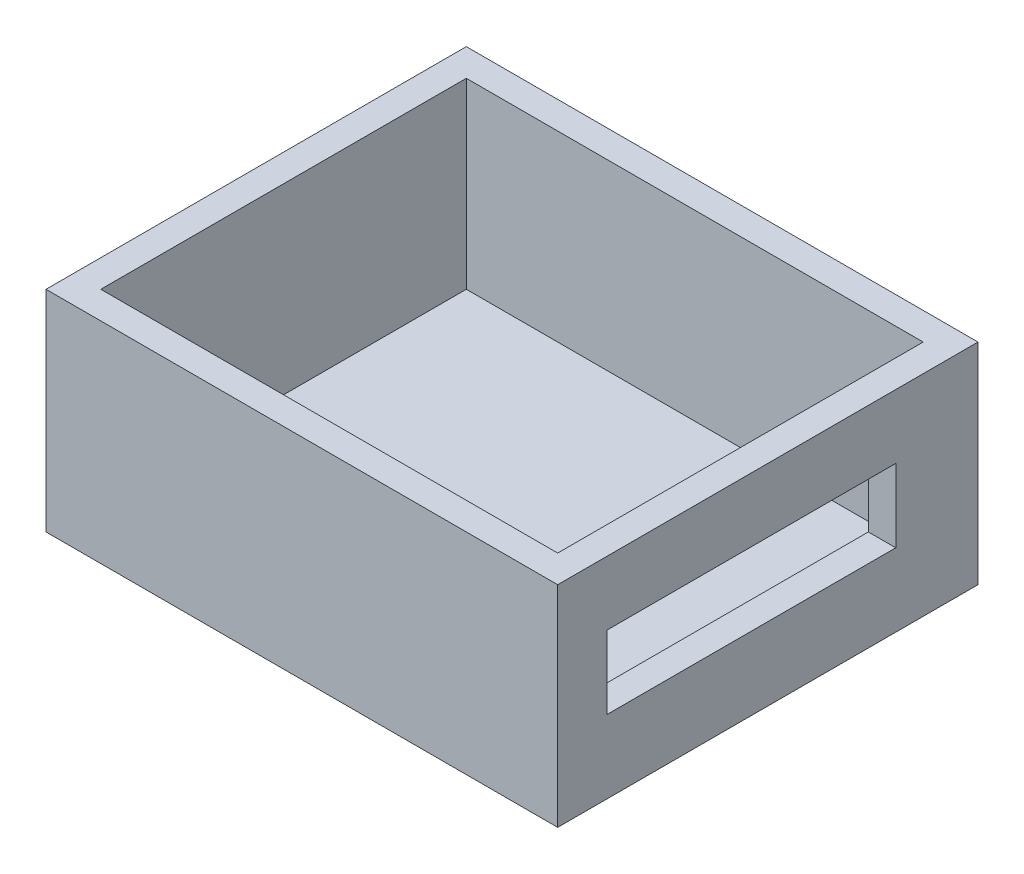
ISO-10303-21;
HEADER;
FILE_DESCRIPTION(('STEP AP214'),'2;1');
FILE_NAME('part.step','',(''),(''),'','','');
FILE_SCHEMA(('AUTOMOTIVE_DESIGN { 1 0 10303 214 1 1 1 1 }'));
ENDSEC;
DATA;
#1=APPLICATION_CONTEXT('core data for automotive mechanical design processes');
#2=APPLICATION_PROTOCOL_DEFINITION('international standard','automotive_design',2000,#1);
#3=PRODUCT_CONTEXT('',#1,'mechanical');
#4=PRODUCT('Part','Part','',(#3));
#5=PRODUCT_RELATED_PRODUCT_CATEGORY('part','',(#4));
#6=PRODUCT_DEFINITION_FORMATION('','',#4);
#7=PRODUCT_DEFINITION_CONTEXT('part definition',#1,'design');
#8=PRODUCT_DEFINITION('design','',#6,#7);
#9=PRODUCT_DEFINITION_SHAPE('','',#8);
#10=(LENGTH_UNIT() NAMED_UNIT(*) SI_UNIT(.MILLI.,.METRE.));
#11=(NAMED_UNIT(*) PLANE_ANGLE_UNIT() SI_UNIT($,.RADIAN.));
#12=(NAMED_UNIT(*) SI_UNIT($,.STERADIAN.) SOLID_ANGLE_UNIT());
#13=UNCERTAINTY_MEASURE_WITH_UNIT(LENGTH_MEASURE(1.E-05),#10,'distance_accuracy_value','');
#14=(GEOMETRIC_REPRESENTATION_CONTEXT(3) GLOBAL_UNCERTAINTY_ASSIGNED_CONTEXT((#13)) GLOBAL_UNIT_ASSIGNED_CONTEXT((#10,
#11,#12)) REPRESENTATION_CONTEXT('',''));
#15=CARTESIAN_POINT('',(0.,0.,0.));
#16=DIRECTION('',(0.,0.,1.));
#17=DIRECTION('',(1.,0.,0.));
#18=AXIS2_PLACEMENT_3D('',#15,#16,#17);
#19=CARTESIAN_POINT('',(0.,1.5,0.));
#20=DIRECTION('',(0.,-1.,0.));
#21=DIRECTION('',(0.,0.,-1.));
#22=AXIS2_PLACEMENT_3D('',#19,#20,#21);
#23=PLANE('',#22);
#24=DIRECTION('',(0.,0.,1.));
#25=VECTOR('',#24,1.);
#26=CARTESIAN_POINT('',(0.,1.5,0.));
#27=LINE('',#26,#25);
#28=CARTESIAN_POINT('',(0.,1.5,-20.));
#29=VERTEX_POINT('',#28);
#30=CARTESIAN_POINT('',(0.,1.5,0.));
#31=VERTEX_POINT('',#30);
#32=EDGE_CURVE('E203',#29,#31,#27,.T.);
#33=ORIENTED_EDGE('',*,*,#32,.T.);
#34=DIRECTION('',(1.,0.,0.));
#35=VECTOR('',#34,1.);
#36=CARTESIAN_POINT('',(0.,1.5,0.));
#37=LINE('',#36,#35);
#38=CARTESIAN_POINT('',(25.,1.5,0.));
#39=VERTEX_POINT('',#38);
#40=EDGE_CURVE('E211',#31,#39,#37,.T.);
#41=ORIENTED_EDGE('',*,*,#40,.T.);
#42=DIRECTION('',(0.,0.,-1.));
#43=VECTOR('',#42,1.);
#44=CARTESIAN_POINT('',(25.,1.5,0.));
#45=LINE('',#44,#43);
#46=CARTESIAN_POINT('',(25.,1.5,-20.));
#47=VERTEX_POINT('',#46);
#48=EDGE_CURVE('E214',#39,#47,#45,.T.);
#49=ORIENTED_EDGE('',*,*,#48,.T.);
#50=DIRECTION('',(-1.,0.,0.));
#51=VECTOR('',#50,1.);
#52=CARTESIAN_POINT('',(0.,1.5,-20.));
#53=LINE('',#52,#51);
#54=EDGE_CURVE('E217',#47,#29,#53,.T.);
#55=ORIENTED_EDGE('',*,*,#54,.T.);
#56=EDGE_LOOP('',(#33,#41,#49,#55));
#57=FACE_BOUND('',#56,.T.);
#58=ADVANCED_FACE('F37',(#57),#23,.F.);
#59=CARTESIAN_POINT('',(25.,11.5,0.));
#60=DIRECTION('',(0.,0.,1.));
#61=DIRECTION('',(1.,0.,0.));
#62=AXIS2_PLACEMENT_3D('',#59,#60,#61);
#63=PLANE('',#62);
#64=DIRECTION('',(0.,-1.,0.));
#65=VECTOR('',#64,1.);
#66=CARTESIAN_POINT('',(25.,11.5,0.));
#67=LINE('',#66,#65);
#68=CARTESIAN_POINT('',(25.,11.5,0.));
#69=VERTEX_POINT('',#68);
#70=EDGE_CURVE('E166',#69,#39,#67,.T.);
#71=ORIENTED_EDGE('',*,*,#70,.T.);
#72=ORIENTED_EDGE('',*,*,#40,.F.);
#73=DIRECTION('',(0.,-1.,0.));
#74=VECTOR('',#73,1.);
#75=CARTESIAN_POINT('',(0.,11.5,0.));
#76=LINE('',#75,#74);
#77=CARTESIAN_POINT('',(0.,11.5,0.));
#78=VERTEX_POINT('',#77);
#79=EDGE_CURVE('E165',#78,#31,#76,.T.);
#80=ORIENTED_EDGE('',*,*,#79,.F.);
#81=DIRECTION('',(-1.,0.,0.));
#82=VECTOR('',#81,1.);
#83=CARTESIAN_POINT('',(25.,11.5,0.));
#84=LINE('',#83,#82);
#85=EDGE_CURVE('E151',#69,#78,#84,.T.);
#86=ORIENTED_EDGE('',*,*,#85,.F.);
#87=EDGE_LOOP('',(#71,#72,#80,#86));
#88=FACE_BOUND('',#87,.T.);
#89=ADVANCED_FACE('F243',(#88),#63,.F.);
#90=CARTESIAN_POINT('',(25.,11.5,-20.));
#91=DIRECTION('',(1.,0.,0.));
#92=DIRECTION('',(0.,0.,-1.));
#93=AXIS2_PLACEMENT_3D('',#90,#91,#92);
#94=PLANE('',#93);
#95=DIRECTION('',(0.,0.,-1.));
#96=VECTOR('',#95,1.);
#97=CARTESIAN_POINT('',(25.,8.,-17.));
#98=LINE('',#97,#96);
#99=CARTESIAN_POINT('',(25.,8.,-1.2));
#100=VERTEX_POINT('',#99);
#101=CARTESIAN_POINT('',(25.,8.,-17.));
#102=VERTEX_POINT('',#101);
#103=EDGE_CURVE('E137',#100,#102,#98,.T.);
#104=ORIENTED_EDGE('',*,*,#103,.F.);
#105=DIRECTION('',(0.,1.,0.));
#106=VECTOR('',#105,1.);
#107=CARTESIAN_POINT('',(25.,8.,-1.2));
#108=LINE('',#107,#106);
#109=CARTESIAN_POINT('',(25.,4.,-1.2));
#110=VERTEX_POINT('',#109);
#111=EDGE_CURVE('E52',#110,#100,#108,.T.);
#112=ORIENTED_EDGE('',*,*,#111,.F.);
#113=DIRECTION('',(0.,0.,1.));
#114=VECTOR('',#113,1.);
#115=CARTESIAN_POINT('',(25.,4.,-17.));
#116=LINE('',#115,#114);
#117=CARTESIAN_POINT('',(25.,4.,-17.));
#118=VERTEX_POINT('',#117);
#119=EDGE_CURVE('E144',#118,#110,#116,.T.);
#120=ORIENTED_EDGE('',*,*,#119,.F.);
#121=DIRECTION('',(0.,-1.,0.));
#122=VECTOR('',#121,1.);
#123=CARTESIAN_POINT('',(25.,8.,-17.));
#124=LINE('',#123,#122);
#125=EDGE_CURVE('E128',#102,#118,#124,.T.);
#126=ORIENTED_EDGE('',*,*,#125,.F.);
#127=EDGE_LOOP('',(#104,#112,#120,#126));
#128=FACE_BOUND('',#127,.T.);
#129=DIRECTION('',(0.,-1.,0.));
#130=VECTOR('',#129,1.);
#131=CARTESIAN_POINT('',(25.,11.5,-20.));
#132=LINE('',#131,#130);
#133=CARTESIAN_POINT('',(25.,11.5,-20.));
#134=VERTEX_POINT('',#133);
#135=EDGE_CURVE('E170',#134,#47,#132,.T.);
#136=ORIENTED_EDGE('',*,*,#135,.T.);
#137=ORIENTED_EDGE('',*,*,#48,.F.);
#138=ORIENTED_EDGE('',*,*,#70,.F.);
#139=DIRECTION('',(0.,0.,1.));
#140=VECTOR('',#139,1.);
#141=CARTESIAN_POINT('',(25.,11.5,-20.));
#142=LINE('',#141,#140);
#143=EDGE_CURVE('E162',#134,#69,#142,.T.);
#144=ORIENTED_EDGE('',*,*,#143,.F.);
#145=EDGE_LOOP('',(#136,#137,#138,#144));
#146=FACE_BOUND('',#145,.T.);
#147=ADVANCED_FACE('F141',(#128,#146),#94,.F.);
#148=CARTESIAN_POINT('',(0.,11.5,-20.));
#149=DIRECTION('',(0.,0.,-1.));
#150=DIRECTION('',(-1.,0.,0.));
#151=AXIS2_PLACEMENT_3D('',#148,#149,#150);
#152=PLANE('',#151);
#153=DIRECTION('',(0.,-1.,0.));
#154=VECTOR('',#153,1.);
#155=CARTESIAN_POINT('',(0.,11.5,-20.));
#156=LINE('',#155,#154);
#157=CARTESIAN_POINT('',(0.,11.5,-20.));
#158=VERTEX_POINT('',#157);
#159=EDGE_CURVE('E173',#158,#29,#156,.T.);
#160=ORIENTED_EDGE('',*,*,#159,.T.);
#161=ORIENTED_EDGE('',*,*,#54,.F.);
#162=ORIENTED_EDGE('',*,*,#135,.F.);
#163=DIRECTION('',(1.,0.,0.));
#164=VECTOR('',#163,1.);
#165=CARTESIAN_POINT('',(0.,11.5,-20.));
#166=LINE('',#165,#164);
#167=EDGE_CURVE('E159',#158,#134,#166,.T.);
#168=ORIENTED_EDGE('',*,*,#167,.F.);
#169=EDGE_LOOP('',(#160,#161,#162,#168));
#170=FACE_BOUND('',#169,.T.);
#171=ADVANCED_FACE('F271',(#170),#152,.F.);
#172=CARTESIAN_POINT('',(0.,11.5,0.));
#173=DIRECTION('',(-1.,0.,0.));
#174=DIRECTION('',(0.,0.,1.));
#175=AXIS2_PLACEMENT_3D('',#172,#173,#174);
#176=PLANE('',#175);
#177=ORIENTED_EDGE('',*,*,#79,.T.);
#178=ORIENTED_EDGE('',*,*,#32,.F.);
#179=ORIENTED_EDGE('',*,*,#159,.F.);
#180=DIRECTION('',(0.,0.,-1.));
#181=VECTOR('',#180,1.);
#182=CARTESIAN_POINT('',(0.,11.5,0.));
#183=LINE('',#182,#181);
#184=EDGE_CURVE('E156',#78,#158,#183,.T.);
#185=ORIENTED_EDGE('',*,*,#184,.F.);
#186=EDGE_LOOP('',(#177,#178,#179,#185));
#187=FACE_BOUND('',#186,.T.);
#188=ADVANCED_FACE('F254',(#187),#176,.F.);
#189=CARTESIAN_POINT('',(26.5,11.5,1.5));
#190=DIRECTION('',(0.,0.,1.));
#191=DIRECTION('',(1.,0.,0.));
#192=AXIS2_PLACEMENT_3D('',#189,#190,#191);
#193=PLANE('',#192);
#194=DIRECTION('',(-1.,0.,0.));
#195=VECTOR('',#194,1.);
#196=CARTESIAN_POINT('',(26.5,0.,1.5));
#197=LINE('',#196,#195);
#198=CARTESIAN_POINT('',(26.5,0.,1.5));
#199=VERTEX_POINT('',#198);
#200=CARTESIAN_POINT('',(-1.5,0.,1.5));
#201=VERTEX_POINT('',#200);
#202=EDGE_CURVE('E169',#199,#201,#197,.T.);
#203=ORIENTED_EDGE('',*,*,#202,.F.);
#204=DIRECTION('',(0.,-1.,0.));
#205=VECTOR('',#204,1.);
#206=CARTESIAN_POINT('',(26.5,11.5,1.5));
#207=LINE('',#206,#205);
#208=CARTESIAN_POINT('',(26.5,11.5,1.5));
#209=VERTEX_POINT('',#208);
#210=EDGE_CURVE('E201',#209,#199,#207,.T.);
#211=ORIENTED_EDGE('',*,*,#210,.F.);
#212=DIRECTION('',(-1.,0.,0.));
#213=VECTOR('',#212,1.);
#214=CARTESIAN_POINT('',(26.5,11.5,1.5));
#215=LINE('',#214,#213);
#216=CARTESIAN_POINT('',(-1.5,11.5,1.5));
#217=VERTEX_POINT('',#216);
#218=EDGE_CURVE('E177',#209,#217,#215,.T.);
#219=ORIENTED_EDGE('',*,*,#218,.T.);
#220=DIRECTION('',(0.,-1.,0.));
#221=VECTOR('',#220,1.);
#222=CARTESIAN_POINT('',(-1.5,11.5,1.5));
#223=LINE('',#222,#221);
#224=EDGE_CURVE('E190',#217,#201,#223,.T.);
#225=ORIENTED_EDGE('',*,*,#224,.T.);
#226=EDGE_LOOP('',(#203,#211,#219,#225));
#227=FACE_BOUND('',#226,.T.);
#228=ADVANCED_FACE('F251',(#227),#193,.T.);
#229=CARTESIAN_POINT('',(26.5,11.5,-21.5));
#230=DIRECTION('',(1.,0.,0.));
#231=DIRECTION('',(0.,0.,-1.));
#232=AXIS2_PLACEMENT_3D('',#229,#230,#231);
#233=PLANE('',#232);
#234=DIRECTION('',(0.,-1.,0.));
#235=VECTOR('',#234,1.);
#236=CARTESIAN_POINT('',(26.5,11.5,-1.2));
#237=LINE('',#236,#235);
#238=CARTESIAN_POINT('',(26.5,8.,-1.2));
#239=VERTEX_POINT('',#238);
#240=CARTESIAN_POINT('',(26.5,4.,-1.2));
#241=VERTEX_POINT('',#240);
#242=EDGE_CURVE('E11',#239,#241,#237,.T.);
#243=ORIENTED_EDGE('',*,*,#242,.F.);
#244=DIRECTION('',(0.,0.,1.));
#245=VECTOR('',#244,1.);
#246=CARTESIAN_POINT('',(26.5,8.,-21.5));
#247=LINE('',#246,#245);
#248=CARTESIAN_POINT('',(26.5,8.,-17.));
#249=VERTEX_POINT('',#248);
#250=EDGE_CURVE('E220',#249,#239,#247,.T.);
#251=ORIENTED_EDGE('',*,*,#250,.F.);
#252=DIRECTION('',(0.,1.,0.));
#253=VECTOR('',#252,1.);
#254=CARTESIAN_POINT('',(26.5,11.5,-17.));
#255=LINE('',#254,#253);
#256=CARTESIAN_POINT('',(26.5,4.,-17.));
#257=VERTEX_POINT('',#256);
#258=EDGE_CURVE('E131',#257,#249,#255,.T.);
#259=ORIENTED_EDGE('',*,*,#258,.F.);
#260=DIRECTION('',(0.,0.,-1.));
#261=VECTOR('',#260,1.);
#262=CARTESIAN_POINT('',(26.5,4.,-21.5));
#263=LINE('',#262,#261);
#264=EDGE_CURVE('E45',#241,#257,#263,.T.);
#265=ORIENTED_EDGE('',*,*,#264,.F.);
#266=EDGE_LOOP('',(#243,#251,#259,#265));
#267=FACE_BOUND('',#266,.T.);
#268=DIRECTION('',(0.,0.,1.));
#269=VECTOR('',#268,1.);
#270=CARTESIAN_POINT('',(26.5,0.,-21.5));
#271=LINE('',#270,#269);
#272=CARTESIAN_POINT('',(26.5,0.,-21.5));
#273=VERTEX_POINT('',#272);
#274=EDGE_CURVE('E181',#273,#199,#271,.T.);
#275=ORIENTED_EDGE('',*,*,#274,.F.);
#276=DIRECTION('',(0.,-1.,0.));
#277=VECTOR('',#276,1.);
#278=CARTESIAN_POINT('',(26.5,11.5,-21.5));
#279=LINE('',#278,#277);
#280=CARTESIAN_POINT('',(26.5,11.5,-21.5));
#281=VERTEX_POINT('',#280);
#282=EDGE_CURVE('E204',#281,#273,#279,.T.);
#283=ORIENTED_EDGE('',*,*,#282,.F.);
#284=DIRECTION('',(0.,0.,1.));
#285=VECTOR('',#284,1.);
#286=CARTESIAN_POINT('',(26.5,11.5,-21.5));
#287=LINE('',#286,#285);
#288=EDGE_CURVE('E187',#281,#209,#287,.T.);
#289=ORIENTED_EDGE('',*,*,#288,.T.);
#290=ORIENTED_EDGE('',*,*,#210,.T.);
#291=EDGE_LOOP('',(#275,#283,#289,#290));
#292=FACE_BOUND('',#291,.T.);
#293=ADVANCED_FACE('F228',(#267,#292),#233,.T.);
#294=CARTESIAN_POINT('',(-1.5,11.5,-21.5));
#295=DIRECTION('',(0.,0.,-1.));
#296=DIRECTION('',(-1.,0.,0.));
#297=AXIS2_PLACEMENT_3D('',#294,#295,#296);
#298=PLANE('',#297);
#299=DIRECTION('',(1.,0.,0.));
#300=VECTOR('',#299,1.);
#301=CARTESIAN_POINT('',(-1.5,0.,-21.5));
#302=LINE('',#301,#300);
#303=CARTESIAN_POINT('',(-1.5,0.,-21.5));
#304=VERTEX_POINT('',#303);
#305=EDGE_CURVE('E196',#304,#273,#302,.T.);
#306=ORIENTED_EDGE('',*,*,#305,.F.);
#307=DIRECTION('',(0.,-1.,0.));
#308=VECTOR('',#307,1.);
#309=CARTESIAN_POINT('',(-1.5,11.5,-21.5));
#310=LINE('',#309,#308);
#311=CARTESIAN_POINT('',(-1.5,11.5,-21.5));
#312=VERTEX_POINT('',#311);
#313=EDGE_CURVE('E206',#312,#304,#310,.T.);
#314=ORIENTED_EDGE('',*,*,#313,.F.);
#315=DIRECTION('',(1.,0.,0.));
#316=VECTOR('',#315,1.);
#317=CARTESIAN_POINT('',(-1.5,11.5,-21.5));
#318=LINE('',#317,#316);
#319=EDGE_CURVE('E184',#312,#281,#318,.T.);
#320=ORIENTED_EDGE('',*,*,#319,.T.);
#321=ORIENTED_EDGE('',*,*,#282,.T.);
#322=EDGE_LOOP('',(#306,#314,#320,#321));
#323=FACE_BOUND('',#322,.T.);
#324=ADVANCED_FACE('F259',(#323),#298,.T.);
#325=CARTESIAN_POINT('',(-1.5,11.5,1.5));
#326=DIRECTION('',(-1.,0.,0.));
#327=DIRECTION('',(0.,0.,1.));
#328=AXIS2_PLACEMENT_3D('',#325,#326,#327);
#329=PLANE('',#328);
#330=DIRECTION('',(0.,0.,-1.));
#331=VECTOR('',#330,1.);
#332=CARTESIAN_POINT('',(-1.5,0.,1.5));
#333=LINE('',#332,#331);
#334=EDGE_CURVE('E193',#201,#304,#333,.T.);
#335=ORIENTED_EDGE('',*,*,#334,.F.);
#336=ORIENTED_EDGE('',*,*,#224,.F.);
#337=DIRECTION('',(0.,0.,-1.));
#338=VECTOR('',#337,1.);
#339=CARTESIAN_POINT('',(-1.5,11.5,1.5));
#340=LINE('',#339,#338);
#341=EDGE_CURVE('E180',#217,#312,#340,.T.);
#342=ORIENTED_EDGE('',*,*,#341,.T.);
#343=ORIENTED_EDGE('',*,*,#313,.T.);
#344=EDGE_LOOP('',(#335,#336,#342,#343));
#345=FACE_BOUND('',#344,.T.);
#346=ADVANCED_FACE('F256',(#345),#329,.T.);
#347=CARTESIAN_POINT('',(0.,11.5,0.));
#348=DIRECTION('',(0.,-1.,0.));
#349=DIRECTION('',(0.,0.,-1.));
#350=AXIS2_PLACEMENT_3D('',#347,#348,#349);
#351=PLANE('',#350);
#352=ORIENTED_EDGE('',*,*,#143,.T.);
#353=ORIENTED_EDGE('',*,*,#85,.T.);
#354=ORIENTED_EDGE('',*,*,#184,.T.);
#355=ORIENTED_EDGE('',*,*,#167,.T.);
#356=EDGE_LOOP('',(#352,#353,#354,#355));
#357=FACE_BOUND('',#356,.T.);
#358=ORIENTED_EDGE('',*,*,#218,.F.);
#359=ORIENTED_EDGE('',*,*,#288,.F.);
#360=ORIENTED_EDGE('',*,*,#319,.F.);
#361=ORIENTED_EDGE('',*,*,#341,.F.);
#362=EDGE_LOOP('',(#358,#359,#360,#361));
#363=FACE_BOUND('',#362,.T.);
#364=ADVANCED_FACE('F238',(#357,#363),#351,.F.);
#365=CARTESIAN_POINT('',(0.,0.,0.));
#366=DIRECTION('',(0.,-1.,0.));
#367=DIRECTION('',(0.,0.,-1.));
#368=AXIS2_PLACEMENT_3D('',#365,#366,#367);
#369=PLANE('',#368);
#370=ORIENTED_EDGE('',*,*,#202,.T.);
#371=ORIENTED_EDGE('',*,*,#334,.T.);
#372=ORIENTED_EDGE('',*,*,#305,.T.);
#373=ORIENTED_EDGE('',*,*,#274,.T.);
#374=EDGE_LOOP('',(#370,#371,#372,#373));
#375=FACE_BOUND('',#374,.T.);
#376=ADVANCED_FACE('F39',(#375),#369,.T.);
#377=CARTESIAN_POINT('',(35.,8.,-1.2));
#378=DIRECTION('',(0.,0.,1.));
#379=DIRECTION('',(1.,0.,0.));
#380=AXIS2_PLACEMENT_3D('',#377,#378,#379);
#381=PLANE('',#380);
#382=ORIENTED_EDGE('',*,*,#242,.T.);
#383=DIRECTION('',(-1.,0.,0.));
#384=VECTOR('',#383,1.);
#385=CARTESIAN_POINT('',(35.,4.,-1.2));
#386=LINE('',#385,#384);
#387=EDGE_CURVE('E149',#241,#110,#386,.T.);
#388=ORIENTED_EDGE('',*,*,#387,.T.);
#389=ORIENTED_EDGE('',*,*,#111,.T.);
#390=DIRECTION('',(-1.,0.,0.));
#391=VECTOR('',#390,1.);
#392=CARTESIAN_POINT('',(35.,8.,-1.2));
#393=LINE('',#392,#391);
#394=EDGE_CURVE('E134',#239,#100,#393,.T.);
#395=ORIENTED_EDGE('',*,*,#394,.F.);
#396=EDGE_LOOP('',(#382,#388,#389,#395));
#397=FACE_BOUND('',#396,.T.);
#398=ADVANCED_FACE('F230',(#397),#381,.F.);
#399=CARTESIAN_POINT('',(35.,4.,-17.));
#400=DIRECTION('',(0.,-1.,0.));
#401=DIRECTION('',(0.,0.,-1.));
#402=AXIS2_PLACEMENT_3D('',#399,#400,#401);
#403=PLANE('',#402);
#404=ORIENTED_EDGE('',*,*,#264,.T.);
#405=DIRECTION('',(-1.,0.,0.));
#406=VECTOR('',#405,1.);
#407=CARTESIAN_POINT('',(35.,4.,-17.));
#408=LINE('',#407,#406);
#409=EDGE_CURVE('E133',#257,#118,#408,.T.);
#410=ORIENTED_EDGE('',*,*,#409,.T.);
#411=ORIENTED_EDGE('',*,*,#119,.T.);
#412=ORIENTED_EDGE('',*,*,#387,.F.);
#413=EDGE_LOOP('',(#404,#410,#411,#412));
#414=FACE_BOUND('',#413,.T.);
#415=ADVANCED_FACE('F225',(#414),#403,.F.);
#416=CARTESIAN_POINT('',(35.,8.,-17.));
#417=DIRECTION('',(0.,0.,-1.));
#418=DIRECTION('',(-1.,0.,0.));
#419=AXIS2_PLACEMENT_3D('',#416,#417,#418);
#420=PLANE('',#419);
#421=ORIENTED_EDGE('',*,*,#258,.T.);
#422=DIRECTION('',(-1.,0.,0.));
#423=VECTOR('',#422,1.);
#424=CARTESIAN_POINT('',(35.,8.,-17.));
#425=LINE('',#424,#423);
#426=EDGE_CURVE('E60',#249,#102,#425,.T.);
#427=ORIENTED_EDGE('',*,*,#426,.T.);
#428=ORIENTED_EDGE('',*,*,#125,.T.);
#429=ORIENTED_EDGE('',*,*,#409,.F.);
#430=EDGE_LOOP('',(#421,#427,#428,#429));
#431=FACE_BOUND('',#430,.T.);
#432=ADVANCED_FACE('F125',(#431),#420,.F.);
#433=CARTESIAN_POINT('',(35.,8.,-17.));
#434=DIRECTION('',(0.,1.,0.));
#435=DIRECTION('',(0.,0.,1.));
#436=AXIS2_PLACEMENT_3D('',#433,#434,#435);
#437=PLANE('',#436);
#438=ORIENTED_EDGE('',*,*,#250,.T.);
#439=ORIENTED_EDGE('',*,*,#394,.T.);
#440=ORIENTED_EDGE('',*,*,#103,.T.);
#441=ORIENTED_EDGE('',*,*,#426,.F.);
#442=EDGE_LOOP('',(#438,#439,#440,#441));
#443=FACE_BOUND('',#442,.T.);
#444=ADVANCED_FACE('F138',(#443),#437,.F.);
#445=CLOSED_SHELL('',(#58,#89,#147,#171,#188,#228,#293,#324,#346,#364,#376,#398,#415,#432,#444));
#446=MANIFOLD_SOLID_BREP('B2',#445);
#447=ADVANCED_BREP_SHAPE_REPRESENTATION('',(#18,#446),#14);
#448=SHAPE_DEFINITION_REPRESENTATION(#9,#447);
ENDSEC;
END-ISO-10303-21;
